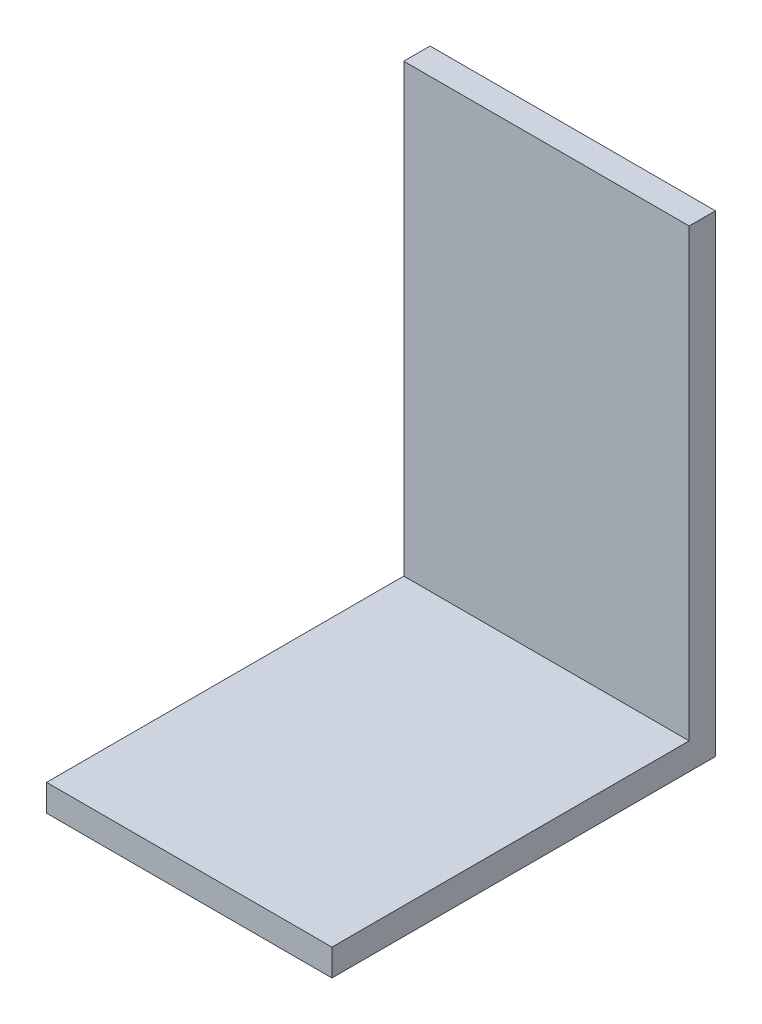
ISO-10303-21;
HEADER;
FILE_DESCRIPTION(('STEP AP214'),'2;1');
FILE_NAME('part.step','',(''),(''),'','','');
FILE_SCHEMA(('AUTOMOTIVE_DESIGN { 1 0 10303 214 1 1 1 1 }'));
ENDSEC;
DATA;
#1=APPLICATION_CONTEXT('core data for automotive mechanical design processes');
#2=APPLICATION_PROTOCOL_DEFINITION('international standard','automotive_design',2000,#1);
#3=PRODUCT_CONTEXT('',#1,'mechanical');
#4=PRODUCT('Part','Part','',(#3));
#5=PRODUCT_RELATED_PRODUCT_CATEGORY('part','',(#4));
#6=PRODUCT_DEFINITION_FORMATION('','',#4);
#7=PRODUCT_DEFINITION_CONTEXT('part definition',#1,'design');
#8=PRODUCT_DEFINITION('design','',#6,#7);
#9=PRODUCT_DEFINITION_SHAPE('','',#8);
#10=(LENGTH_UNIT() NAMED_UNIT(*) SI_UNIT(.MILLI.,.METRE.));
#11=(NAMED_UNIT(*) PLANE_ANGLE_UNIT() SI_UNIT($,.RADIAN.));
#12=(NAMED_UNIT(*) SI_UNIT($,.STERADIAN.) SOLID_ANGLE_UNIT());
#13=UNCERTAINTY_MEASURE_WITH_UNIT(LENGTH_MEASURE(1.E-05),#10,'distance_accuracy_value','');
#14=(GEOMETRIC_REPRESENTATION_CONTEXT(3) GLOBAL_UNCERTAINTY_ASSIGNED_CONTEXT((#13)) GLOBAL_UNIT_ASSIGNED_CONTEXT((#10,
#11,#12)) REPRESENTATION_CONTEXT('',''));
#15=CARTESIAN_POINT('',(0.,0.,0.));
#16=DIRECTION('',(0.,0.,1.));
#17=DIRECTION('',(1.,0.,0.));
#18=AXIS2_PLACEMENT_3D('',#15,#16,#17);
#19=CARTESIAN_POINT('',(0.,3.00000000000001,0.));
#20=DIRECTION('',(0.,-1.,0.));
#21=DIRECTION('',(0.,0.,-1.));
#22=AXIS2_PLACEMENT_3D('',#19,#20,#21);
#23=PLANE('',#22);
#24=DIRECTION('',(1.,0.,0.));
#25=VECTOR('',#24,1.);
#26=CARTESIAN_POINT('',(0.,3.00000000000001,-40.0511732238154));
#27=LINE('',#26,#25);
#28=CARTESIAN_POINT('',(0.,3.00000000000001,-40.0511732238154));
#29=VERTEX_POINT('',#28);
#30=CARTESIAN_POINT('',(32.,3.00000000000001,-40.0511732238154));
#31=VERTEX_POINT('',#30);
#32=EDGE_CURVE('E50',#29,#31,#27,.T.);
#33=ORIENTED_EDGE('',*,*,#32,.F.);
#34=DIRECTION('',(0.,0.,1.));
#35=VECTOR('',#34,1.);
#36=CARTESIAN_POINT('',(0.,3.00000000000001,0.));
#37=LINE('',#36,#35);
#38=CARTESIAN_POINT('',(0.,3.00000000000001,0.));
#39=VERTEX_POINT('',#38);
#40=EDGE_CURVE('E87',#29,#39,#37,.T.);
#41=ORIENTED_EDGE('',*,*,#40,.T.);
#42=DIRECTION('',(1.,0.,0.));
#43=VECTOR('',#42,1.);
#44=CARTESIAN_POINT('',(0.,3.00000000000001,0.));
#45=LINE('',#44,#43);
#46=CARTESIAN_POINT('',(32.,3.00000000000001,0.));
#47=VERTEX_POINT('',#46);
#48=EDGE_CURVE('E56',#39,#47,#45,.T.);
#49=ORIENTED_EDGE('',*,*,#48,.T.);
#50=DIRECTION('',(0.,0.,-1.));
#51=VECTOR('',#50,1.);
#52=CARTESIAN_POINT('',(32.,3.00000000000001,0.));
#53=LINE('',#52,#51);
#54=EDGE_CURVE('E98',#47,#31,#53,.T.);
#55=ORIENTED_EDGE('',*,*,#54,.T.);
#56=EDGE_LOOP('',(#33,#41,#49,#55));
#57=FACE_BOUND('',#56,.T.);
#58=ADVANCED_FACE('F35',(#57),#23,.F.);
#59=CARTESIAN_POINT('',(0.,3.00000000000001,0.));
#60=DIRECTION('',(1.,0.,0.));
#61=DIRECTION('',(0.,0.,-1.));
#62=AXIS2_PLACEMENT_3D('',#59,#60,#61);
#63=PLANE('',#62);
#64=DIRECTION('',(0.,0.,1.));
#65=VECTOR('',#64,1.);
#66=CARTESIAN_POINT('',(0.,0.,0.));
#67=LINE('',#66,#65);
#68=CARTESIAN_POINT('',(0.,0.,-43.));
#69=VERTEX_POINT('',#68);
#70=CARTESIAN_POINT('',(0.,0.,0.));
#71=VERTEX_POINT('',#70);
#72=EDGE_CURVE('E94',#69,#71,#67,.T.);
#73=ORIENTED_EDGE('',*,*,#72,.T.);
#74=DIRECTION('',(0.,-1.,0.));
#75=VECTOR('',#74,1.);
#76=CARTESIAN_POINT('',(0.,3.00000000000001,0.));
#77=LINE('',#76,#75);
#78=EDGE_CURVE('E11',#39,#71,#77,.T.);
#79=ORIENTED_EDGE('',*,*,#78,.F.);
#80=ORIENTED_EDGE('',*,*,#40,.F.);
#81=DIRECTION('',(0.,-1.,0.));
#82=VECTOR('',#81,1.);
#83=CARTESIAN_POINT('',(0.,53.0000000000001,-40.0511732238154));
#84=LINE('',#83,#82);
#85=CARTESIAN_POINT('',(0.,53.0000000000001,-40.0511732238154));
#86=VERTEX_POINT('',#85);
#87=EDGE_CURVE('E102',#86,#29,#84,.T.);
#88=ORIENTED_EDGE('',*,*,#87,.F.);
#89=DIRECTION('',(0.,0.,1.));
#90=VECTOR('',#89,1.);
#91=CARTESIAN_POINT('',(0.,53.0000000000001,-43.));
#92=LINE('',#91,#90);
#93=CARTESIAN_POINT('',(0.,53.0000000000001,-43.));
#94=VERTEX_POINT('',#93);
#95=EDGE_CURVE('E97',#94,#86,#92,.T.);
#96=ORIENTED_EDGE('',*,*,#95,.F.);
#97=DIRECTION('',(0.,-1.,0.));
#98=VECTOR('',#97,1.);
#99=CARTESIAN_POINT('',(0.,3.00000000000001,-43.));
#100=LINE('',#99,#98);
#101=EDGE_CURVE('E80',#94,#69,#100,.T.);
#102=ORIENTED_EDGE('',*,*,#101,.T.);
#103=EDGE_LOOP('',(#73,#79,#80,#88,#96,#102));
#104=FACE_BOUND('',#103,.T.);
#105=ADVANCED_FACE('F37',(#104),#63,.F.);
#106=CARTESIAN_POINT('',(0.,3.00000000000001,0.));
#107=DIRECTION('',(0.,0.,-1.));
#108=DIRECTION('',(-1.,0.,0.));
#109=AXIS2_PLACEMENT_3D('',#106,#107,#108);
#110=PLANE('',#109);
#111=DIRECTION('',(1.,0.,0.));
#112=VECTOR('',#111,1.);
#113=CARTESIAN_POINT('',(0.,0.,0.));
#114=LINE('',#113,#112);
#115=CARTESIAN_POINT('',(32.,0.,0.));
#116=VERTEX_POINT('',#115);
#117=EDGE_CURVE('E101',#71,#116,#114,.T.);
#118=ORIENTED_EDGE('',*,*,#117,.T.);
#119=DIRECTION('',(0.,-1.,0.));
#120=VECTOR('',#119,1.);
#121=CARTESIAN_POINT('',(32.,3.00000000000001,0.));
#122=LINE('',#121,#120);
#123=EDGE_CURVE('E43',#47,#116,#122,.T.);
#124=ORIENTED_EDGE('',*,*,#123,.F.);
#125=ORIENTED_EDGE('',*,*,#48,.F.);
#126=ORIENTED_EDGE('',*,*,#78,.T.);
#127=EDGE_LOOP('',(#118,#124,#125,#126));
#128=FACE_BOUND('',#127,.T.);
#129=ADVANCED_FACE('F118',(#128),#110,.F.);
#130=CARTESIAN_POINT('',(32.,3.00000000000001,0.));
#131=DIRECTION('',(-1.,0.,0.));
#132=DIRECTION('',(0.,0.,1.));
#133=AXIS2_PLACEMENT_3D('',#130,#131,#132);
#134=PLANE('',#133);
#135=DIRECTION('',(0.,0.,-1.));
#136=VECTOR('',#135,1.);
#137=CARTESIAN_POINT('',(32.,0.,0.));
#138=LINE('',#137,#136);
#139=CARTESIAN_POINT('',(32.,0.,-43.));
#140=VERTEX_POINT('',#139);
#141=EDGE_CURVE('E88',#116,#140,#138,.T.);
#142=ORIENTED_EDGE('',*,*,#141,.T.);
#143=DIRECTION('',(0.,-1.,0.));
#144=VECTOR('',#143,1.);
#145=CARTESIAN_POINT('',(32.,3.00000000000001,-43.));
#146=LINE('',#145,#144);
#147=CARTESIAN_POINT('',(32.,53.0000000000001,-43.));
#148=VERTEX_POINT('',#147);
#149=EDGE_CURVE('E83',#148,#140,#146,.T.);
#150=ORIENTED_EDGE('',*,*,#149,.F.);
#151=DIRECTION('',(0.,0.,-1.));
#152=VECTOR('',#151,1.);
#153=CARTESIAN_POINT('',(32.,53.0000000000001,-43.));
#154=LINE('',#153,#152);
#155=CARTESIAN_POINT('',(32.,53.0000000000001,-40.0511732238154));
#156=VERTEX_POINT('',#155);
#157=EDGE_CURVE('E133',#156,#148,#154,.T.);
#158=ORIENTED_EDGE('',*,*,#157,.F.);
#159=DIRECTION('',(0.,-1.,0.));
#160=VECTOR('',#159,1.);
#161=CARTESIAN_POINT('',(32.,53.0000000000001,-40.0511732238154));
#162=LINE('',#161,#160);
#163=EDGE_CURVE('E106',#156,#31,#162,.T.);
#164=ORIENTED_EDGE('',*,*,#163,.T.);
#165=ORIENTED_EDGE('',*,*,#54,.F.);
#166=ORIENTED_EDGE('',*,*,#123,.T.);
#167=EDGE_LOOP('',(#142,#150,#158,#164,#165,#166));
#168=FACE_BOUND('',#167,.T.);
#169=ADVANCED_FACE('F115',(#168),#134,.F.);
#170=CARTESIAN_POINT('',(0.,3.00000000000001,-43.));
#171=DIRECTION('',(0.,0.,1.));
#172=DIRECTION('',(1.,0.,0.));
#173=AXIS2_PLACEMENT_3D('',#170,#171,#172);
#174=PLANE('',#173);
#175=DIRECTION('',(-1.,0.,0.));
#176=VECTOR('',#175,1.);
#177=CARTESIAN_POINT('',(0.,0.,-43.));
#178=LINE('',#177,#176);
#179=EDGE_CURVE('E76',#140,#69,#178,.T.);
#180=ORIENTED_EDGE('',*,*,#179,.T.);
#181=ORIENTED_EDGE('',*,*,#101,.F.);
#182=DIRECTION('',(-1.,0.,0.));
#183=VECTOR('',#182,1.);
#184=CARTESIAN_POINT('',(0.,53.0000000000001,-43.));
#185=LINE('',#184,#183);
#186=EDGE_CURVE('E136',#148,#94,#185,.T.);
#187=ORIENTED_EDGE('',*,*,#186,.F.);
#188=ORIENTED_EDGE('',*,*,#149,.T.);
#189=EDGE_LOOP('',(#180,#181,#187,#188));
#190=FACE_BOUND('',#189,.T.);
#191=ADVANCED_FACE('F78',(#190),#174,.F.);
#192=CARTESIAN_POINT('',(0.,0.,0.));
#193=DIRECTION('',(0.,-1.,0.));
#194=DIRECTION('',(0.,0.,-1.));
#195=AXIS2_PLACEMENT_3D('',#192,#193,#194);
#196=PLANE('',#195);
#197=ORIENTED_EDGE('',*,*,#72,.F.);
#198=ORIENTED_EDGE('',*,*,#179,.F.);
#199=ORIENTED_EDGE('',*,*,#141,.F.);
#200=ORIENTED_EDGE('',*,*,#117,.F.);
#201=EDGE_LOOP('',(#197,#198,#199,#200));
#202=FACE_BOUND('',#201,.T.);
#203=ADVANCED_FACE('F100',(#202),#196,.T.);
#204=CARTESIAN_POINT('',(0.,53.0000000000001,-40.0511732238154));
#205=DIRECTION('',(0.,0.,-1.));
#206=DIRECTION('',(-1.,0.,0.));
#207=AXIS2_PLACEMENT_3D('',#204,#205,#206);
#208=PLANE('',#207);
#209=ORIENTED_EDGE('',*,*,#32,.T.);
#210=ORIENTED_EDGE('',*,*,#163,.F.);
#211=DIRECTION('',(1.,0.,0.));
#212=VECTOR('',#211,1.);
#213=CARTESIAN_POINT('',(0.,53.0000000000001,-40.0511732238154));
#214=LINE('',#213,#212);
#215=EDGE_CURVE('E127',#86,#156,#214,.T.);
#216=ORIENTED_EDGE('',*,*,#215,.F.);
#217=ORIENTED_EDGE('',*,*,#87,.T.);
#218=EDGE_LOOP('',(#209,#210,#216,#217));
#219=FACE_BOUND('',#218,.T.);
#220=ADVANCED_FACE('F123',(#219),#208,.F.);
#221=CARTESIAN_POINT('',(0.,53.0000000000001,0.));
#222=DIRECTION('',(0.,1.,0.));
#223=DIRECTION('',(0.,0.,1.));
#224=AXIS2_PLACEMENT_3D('',#221,#222,#223);
#225=PLANE('',#224);
#226=ORIENTED_EDGE('',*,*,#95,.T.);
#227=ORIENTED_EDGE('',*,*,#215,.T.);
#228=ORIENTED_EDGE('',*,*,#157,.T.);
#229=ORIENTED_EDGE('',*,*,#186,.T.);
#230=EDGE_LOOP('',(#226,#227,#228,#229));
#231=FACE_BOUND('',#230,.T.);
#232=ADVANCED_FACE('F135',(#231),#225,.T.);
#233=CLOSED_SHELL('',(#58,#105,#129,#169,#191,#203,#220,#232));
#234=MANIFOLD_SOLID_BREP('B2',#233);
#235=ADVANCED_BREP_SHAPE_REPRESENTATION('',(#18,#234),#14);
#236=SHAPE_DEFINITION_REPRESENTATION(#9,#235);
ENDSEC;
END-ISO-10303-21;
